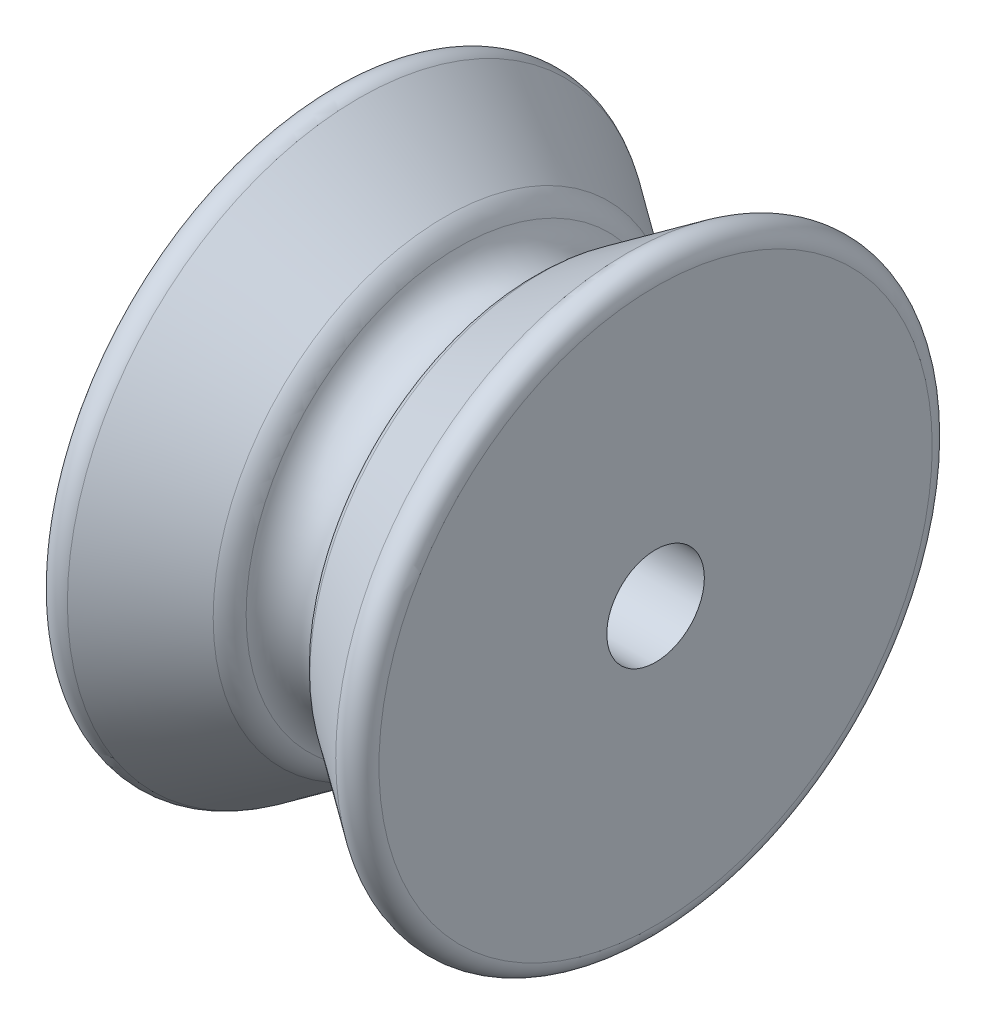
ISO-10303-21;
HEADER;
FILE_DESCRIPTION(('STEP AP214'),'2;1');
FILE_NAME('part.step','',(''),(''),'','','');
FILE_SCHEMA(('AUTOMOTIVE_DESIGN { 1 0 10303 214 1 1 1 1 }'));
ENDSEC;
DATA;
#1=APPLICATION_CONTEXT('core data for automotive mechanical design processes');
#2=APPLICATION_PROTOCOL_DEFINITION('international standard','automotive_design',2000,#1);
#3=PRODUCT_CONTEXT('',#1,'mechanical');
#4=PRODUCT('Part','Part','',(#3));
#5=PRODUCT_RELATED_PRODUCT_CATEGORY('part','',(#4));
#6=PRODUCT_DEFINITION_FORMATION('','',#4);
#7=PRODUCT_DEFINITION_CONTEXT('part definition',#1,'design');
#8=PRODUCT_DEFINITION('design','',#6,#7);
#9=PRODUCT_DEFINITION_SHAPE('','',#8);
#10=(LENGTH_UNIT() NAMED_UNIT(*) SI_UNIT(.MILLI.,.METRE.));
#11=(NAMED_UNIT(*) PLANE_ANGLE_UNIT() SI_UNIT($,.RADIAN.));
#12=(NAMED_UNIT(*) SI_UNIT($,.STERADIAN.) SOLID_ANGLE_UNIT());
#13=UNCERTAINTY_MEASURE_WITH_UNIT(LENGTH_MEASURE(1.E-05),#10,'distance_accuracy_value','');
#14=(GEOMETRIC_REPRESENTATION_CONTEXT(3) GLOBAL_UNCERTAINTY_ASSIGNED_CONTEXT((#13)) GLOBAL_UNIT_ASSIGNED_CONTEXT((#10,
#11,#12)) REPRESENTATION_CONTEXT('',''));
#15=CARTESIAN_POINT('',(0.,0.,0.));
#16=DIRECTION('',(0.,0.,1.));
#17=DIRECTION('',(1.,0.,0.));
#18=AXIS2_PLACEMENT_3D('',#15,#16,#17);
#19=CARTESIAN_POINT('',(18.,0.,0.));
#20=DIRECTION('',(1.,0.,0.));
#21=DIRECTION('',(0.,0.,-1.));
#22=AXIS2_PLACEMENT_3D('',#19,#20,#21);
#23=PLANE('',#22);
#24=CARTESIAN_POINT('',(18.,0.,0.));
#25=DIRECTION('',(1.,0.,0.));
#26=DIRECTION('',(0.,0.,-1.));
#27=AXIS2_PLACEMENT_3D('',#24,#25,#26);
#28=CIRCLE('',#27,15.3129789700608);
#29=CARTESIAN_POINT('',(18.,0.,-15.3129789700608));
#30=VERTEX_POINT('',#29);
#31=EDGE_CURVE('E54',#30,#30,#28,.T.);
#32=ORIENTED_EDGE('',*,*,#31,.T.);
#33=EDGE_LOOP('',(#32));
#34=FACE_BOUND('',#33,.T.);
#35=CARTESIAN_POINT('',(18.,0.,0.));
#36=DIRECTION('',(1.,0.,0.));
#37=DIRECTION('',(0.,0.,-1.));
#38=AXIS2_PLACEMENT_3D('',#35,#36,#37);
#39=CIRCLE('',#38,2.7);
#40=CARTESIAN_POINT('',(18.,0.,-2.7));
#41=VERTEX_POINT('',#40);
#42=EDGE_CURVE('E64',#41,#41,#39,.T.);
#43=ORIENTED_EDGE('',*,*,#42,.F.);
#44=EDGE_LOOP('',(#43));
#45=FACE_BOUND('',#44,.T.);
#46=ADVANCED_FACE('F31',(#34,#45),#23,.T.);
#47=CARTESIAN_POINT('',(0.,0.,0.));
#48=DIRECTION('',(1.,0.,0.));
#49=DIRECTION('',(0.,0.,-1.));
#50=AXIS2_PLACEMENT_3D('',#47,#48,#49);
#51=PLANE('',#50);
#52=CARTESIAN_POINT('',(0.,0.,0.));
#53=DIRECTION('',(1.,0.,0.));
#54=DIRECTION('',(0.,0.,-1.));
#55=AXIS2_PLACEMENT_3D('',#52,#53,#54);
#56=CIRCLE('',#55,15.3129789700608);
#57=CARTESIAN_POINT('',(0.,0.,-15.3129789700608));
#58=VERTEX_POINT('',#57);
#59=EDGE_CURVE('E57',#58,#58,#56,.F.);
#60=ORIENTED_EDGE('',*,*,#59,.T.);
#61=EDGE_LOOP('',(#60));
#62=FACE_BOUND('',#61,.T.);
#63=CARTESIAN_POINT('',(0.,0.,0.));
#64=DIRECTION('',(1.,0.,0.));
#65=DIRECTION('',(0.,0.,-1.));
#66=AXIS2_PLACEMENT_3D('',#63,#64,#65);
#67=CIRCLE('',#66,2.7);
#68=CARTESIAN_POINT('',(0.,0.,-2.7));
#69=VERTEX_POINT('',#68);
#70=EDGE_CURVE('E63',#69,#69,#67,.T.);
#71=ORIENTED_EDGE('',*,*,#70,.T.);
#72=EDGE_LOOP('',(#71));
#73=FACE_BOUND('',#72,.T.);
#74=ADVANCED_FACE('F70',(#62,#73),#51,.F.);
#75=CARTESIAN_POINT('',(0.,0.,0.));
#76=DIRECTION('',(1.,0.,0.));
#77=DIRECTION('',(0.,0.,-1.));
#78=AXIS2_PLACEMENT_3D('',#75,#76,#77);
#79=CYLINDRICAL_SURFACE('',#78,2.7);
#80=ORIENTED_EDGE('',*,*,#70,.F.);
#81=EDGE_LOOP('',(#80));
#82=FACE_BOUND('',#81,.T.);
#83=ORIENTED_EDGE('',*,*,#42,.T.);
#84=EDGE_LOOP('',(#83));
#85=FACE_BOUND('',#84,.T.);
#86=ADVANCED_FACE('F72',(#82,#85),#79,.F.);
#87=CARTESIAN_POINT('',(-9.09161837915974,0.,0.));
#88=DIRECTION('',(-1.,0.,0.));
#89=DIRECTION('',(0.,0.,1.));
#90=AXIS2_PLACEMENT_3D('',#87,#88,#89);
#91=CONICAL_SURFACE('',#90,23.5999808206455,0.610865238198013);
#92=CARTESIAN_POINT('',(6.31962203387384,0.,0.));
#93=DIRECTION('',(1.,0.,0.));
#94=DIRECTION('',(0.,0.,-1.));
#95=AXIS2_PLACEMENT_3D('',#92,#93,#94);
#96=CIRCLE('',#95,12.8089141102773);
#97=CARTESIAN_POINT('',(6.31962203387384,0.,-12.8089141102773));
#98=VERTEX_POINT('',#97);
#99=EDGE_CURVE('E46',#98,#98,#96,.F.);
#100=ORIENTED_EDGE('',*,*,#99,.T.);
#101=EDGE_LOOP('',(#100));
#102=FACE_BOUND('',#101,.T.);
#103=CARTESIAN_POINT('',(1.57357643635104,0.,0.));
#104=DIRECTION('',(-1.,0.,0.));
#105=DIRECTION('',(0.,0.,1.));
#106=AXIS2_PLACEMENT_3D('',#103,#104,#105);
#107=CIRCLE('',#106,16.1321310143498);
#108=CARTESIAN_POINT('',(1.57357643635104,0.,16.1321310143498));
#109=VERTEX_POINT('',#108);
#110=EDGE_CURVE('E60',#109,#109,#107,.F.);
#111=ORIENTED_EDGE('',*,*,#110,.T.);
#112=EDGE_LOOP('',(#111));
#113=FACE_BOUND('',#112,.T.);
#114=ADVANCED_FACE('F75',(#102,#113),#91,.T.);
#115=CARTESIAN_POINT('',(11.,0.,0.));
#116=DIRECTION('',(1.,0.,0.));
#117=DIRECTION('',(0.,0.,-1.));
#118=AXIS2_PLACEMENT_3D('',#115,#116,#117);
#119=CONICAL_SURFACE('',#118,12.332508329564,0.610865238198013);
#120=CARTESIAN_POINT('',(11.6803779661262,0.,0.));
#121=DIRECTION('',(-1.,0.,0.));
#122=DIRECTION('',(0.,0.,1.));
#123=AXIS2_PLACEMENT_3D('',#120,#121,#122);
#124=CIRCLE('',#123,12.8089141102773);
#125=CARTESIAN_POINT('',(11.6803779661262,0.,12.8089141102773));
#126=VERTEX_POINT('',#125);
#127=EDGE_CURVE('E10',#126,#126,#124,.F.);
#128=ORIENTED_EDGE('',*,*,#127,.T.);
#129=EDGE_LOOP('',(#128));
#130=FACE_BOUND('',#129,.T.);
#131=CARTESIAN_POINT('',(16.426423563649,0.,0.));
#132=DIRECTION('',(-1.,0.,0.));
#133=DIRECTION('',(0.,0.,1.));
#134=AXIS2_PLACEMENT_3D('',#131,#132,#133);
#135=CIRCLE('',#134,16.1321310143498);
#136=CARTESIAN_POINT('',(16.426423563649,0.,16.1321310143498));
#137=VERTEX_POINT('',#136);
#138=EDGE_CURVE('E51',#137,#137,#135,.T.);
#139=ORIENTED_EDGE('',*,*,#138,.T.);
#140=EDGE_LOOP('',(#139));
#141=FACE_BOUND('',#140,.T.);
#142=ADVANCED_FACE('F109',(#130,#141),#119,.T.);
#143=CARTESIAN_POINT('',(9.,0.,0.));
#144=DIRECTION('',(-1.,0.,0.));
#145=DIRECTION('',(0.,0.,1.));
#146=AXIS2_PLACEMENT_3D('',#143,#144,#145);
#147=TOROIDAL_SURFACE('',#146,12.332508329564,2.);
#148=CARTESIAN_POINT('',(7.08623458058567,0.,0.));
#149=DIRECTION('',(1.,0.,0.));
#150=DIRECTION('',(0.,0.,-1.));
#151=AXIS2_PLACEMENT_3D('',#148,#149,#150);
#152=CIRCLE('',#151,11.7515591756316);
#153=CARTESIAN_POINT('',(7.08623458058567,0.,-11.7515591756316));
#154=VERTEX_POINT('',#153);
#155=EDGE_CURVE('E38',#154,#154,#152,.T.);
#156=ORIENTED_EDGE('',*,*,#155,.T.);
#157=EDGE_LOOP('',(#156));
#158=FACE_BOUND('',#157,.T.);
#159=CARTESIAN_POINT('',(10.9137654194141,0.,0.));
#160=DIRECTION('',(-1.,0.,0.));
#161=DIRECTION('',(0.,0.,1.));
#162=AXIS2_PLACEMENT_3D('',#159,#160,#161);
#163=CIRCLE('',#162,11.7515591756317);
#164=CARTESIAN_POINT('',(10.9137654194141,0.,11.7515591756317));
#165=VERTEX_POINT('',#164);
#166=EDGE_CURVE('E42',#165,#165,#163,.T.);
#167=ORIENTED_EDGE('',*,*,#166,.T.);
#168=EDGE_LOOP('',(#167));
#169=FACE_BOUND('',#168,.T.);
#170=ADVANCED_FACE('F93',(#158,#169),#147,.F.);
#171=CARTESIAN_POINT('',(0.999999999999999,0.,0.));
#172=DIRECTION('',(1.,0.,0.));
#173=DIRECTION('',(0.,0.,-1.));
#174=AXIS2_PLACEMENT_3D('',#171,#172,#173);
#175=TOROIDAL_SURFACE('',#174,15.3129789700608,1.);
#176=ORIENTED_EDGE('',*,*,#59,.F.);
#177=EDGE_LOOP('',(#176));
#178=FACE_BOUND('',#177,.T.);
#179=ORIENTED_EDGE('',*,*,#110,.F.);
#180=EDGE_LOOP('',(#179));
#181=FACE_BOUND('',#180,.T.);
#182=ADVANCED_FACE('F89',(#178,#181),#175,.T.);
#183=CARTESIAN_POINT('',(17.,0.,0.));
#184=DIRECTION('',(1.,0.,0.));
#185=DIRECTION('',(0.,0.,-1.));
#186=AXIS2_PLACEMENT_3D('',#183,#184,#185);
#187=TOROIDAL_SURFACE('',#186,15.3129789700608,1.);
#188=ORIENTED_EDGE('',*,*,#138,.F.);
#189=EDGE_LOOP('',(#188));
#190=FACE_BOUND('',#189,.T.);
#191=ORIENTED_EDGE('',*,*,#31,.F.);
#192=EDGE_LOOP('',(#191));
#193=FACE_BOUND('',#192,.T.);
#194=ADVANCED_FACE('F92',(#190,#193),#187,.T.);
#195=CARTESIAN_POINT('',(5.17246916117176,0.,0.));
#196=DIRECTION('',(1.,0.,0.));
#197=DIRECTION('',(0.,0.,-1.));
#198=AXIS2_PLACEMENT_3D('',#195,#196,#197);
#199=TOROIDAL_SURFACE('',#198,11.1706100216993,2.);
#200=ORIENTED_EDGE('',*,*,#155,.F.);
#201=EDGE_LOOP('',(#200));
#202=FACE_BOUND('',#201,.T.);
#203=ORIENTED_EDGE('',*,*,#99,.F.);
#204=EDGE_LOOP('',(#203));
#205=FACE_BOUND('',#204,.T.);
#206=ADVANCED_FACE('F96',(#202,#205),#199,.T.);
#207=CARTESIAN_POINT('',(12.8275308388282,0.,0.));
#208=DIRECTION('',(1.,0.,0.));
#209=DIRECTION('',(0.,0.,-1.));
#210=AXIS2_PLACEMENT_3D('',#207,#208,#209);
#211=TOROIDAL_SURFACE('',#210,11.1706100216993,2.);
#212=ORIENTED_EDGE('',*,*,#127,.F.);
#213=EDGE_LOOP('',(#212));
#214=FACE_BOUND('',#213,.T.);
#215=ORIENTED_EDGE('',*,*,#166,.F.);
#216=EDGE_LOOP('',(#215));
#217=FACE_BOUND('',#216,.T.);
#218=ADVANCED_FACE('F33',(#214,#217),#211,.T.);
#219=CLOSED_SHELL('',(#46,#74,#86,#114,#142,#170,#182,#194,#206,#218));
#220=MANIFOLD_SOLID_BREP('B2',#219);
#221=ADVANCED_BREP_SHAPE_REPRESENTATION('',(#18,#220),#14);
#222=SHAPE_DEFINITION_REPRESENTATION(#9,#221);
ENDSEC;
END-ISO-10303-21;
